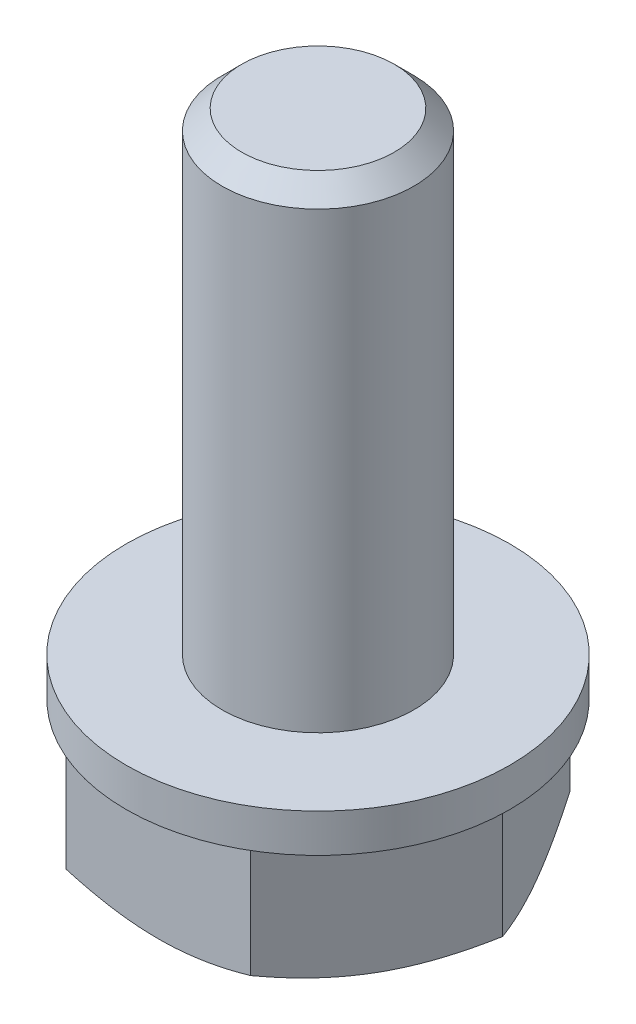
ISO-10303-21;
HEADER;
FILE_DESCRIPTION(('STEP AP214'),'2;1');
FILE_NAME('part.step','',(''),(''),'','','');
FILE_SCHEMA(('AUTOMOTIVE_DESIGN { 1 0 10303 214 1 1 1 1 }'));
ENDSEC;
DATA;
#1=APPLICATION_CONTEXT('core data for automotive mechanical design processes');
#2=APPLICATION_PROTOCOL_DEFINITION('international standard','automotive_design',2000,#1);
#3=PRODUCT_CONTEXT('',#1,'mechanical');
#4=PRODUCT('Part','Part','',(#3));
#5=PRODUCT_RELATED_PRODUCT_CATEGORY('part','',(#4));
#6=PRODUCT_DEFINITION_FORMATION('','',#4);
#7=PRODUCT_DEFINITION_CONTEXT('part definition',#1,'design');
#8=PRODUCT_DEFINITION('design','',#6,#7);
#9=PRODUCT_DEFINITION_SHAPE('','',#8);
#10=(LENGTH_UNIT() NAMED_UNIT(*) SI_UNIT(.MILLI.,.METRE.));
#11=(NAMED_UNIT(*) PLANE_ANGLE_UNIT() SI_UNIT($,.RADIAN.));
#12=(NAMED_UNIT(*) SI_UNIT($,.STERADIAN.) SOLID_ANGLE_UNIT());
#13=UNCERTAINTY_MEASURE_WITH_UNIT(LENGTH_MEASURE(1.E-05),#10,'distance_accuracy_value','');
#14=(GEOMETRIC_REPRESENTATION_CONTEXT(3) GLOBAL_UNCERTAINTY_ASSIGNED_CONTEXT((#13)) GLOBAL_UNIT_ASSIGNED_CONTEXT((#10,
#11,#12)) REPRESENTATION_CONTEXT('',''));
#15=CARTESIAN_POINT('',(0.,0.,0.));
#16=DIRECTION('',(0.,0.,1.));
#17=DIRECTION('',(1.,0.,0.));
#18=AXIS2_PLACEMENT_3D('',#15,#16,#17);
#19=CARTESIAN_POINT('',(-17.677669529664,-54.8,15.177669529664));
#20=DIRECTION('',(0.,-1.,0.));
#21=DIRECTION('',(0.,0.,-1.));
#22=AXIS2_PLACEMENT_3D('',#19,#20,#21);
#23=PLANE('',#22);
#24=CARTESIAN_POINT('',(-17.677669529664,-54.8,17.677669529664));
#25=DIRECTION('',(0.,-1.,0.));
#26=DIRECTION('',(0.,0.,-1.));
#27=AXIS2_PLACEMENT_3D('',#24,#25,#26);
#28=CIRCLE('',#27,5.);
#29=CARTESIAN_POINT('',(-17.677669529664,-54.8,12.677669529664));
#30=VERTEX_POINT('',#29);
#31=CARTESIAN_POINT('',(-13.3475425107418,-54.8,15.1776695296639));
#32=VERTEX_POINT('',#31);
#33=EDGE_CURVE('E93',#30,#32,#28,.T.);
#34=ORIENTED_EDGE('',*,*,#33,.T.);
#35=CARTESIAN_POINT('',(-17.677669529664,-54.8,17.677669529664));
#36=DIRECTION('',(0.,-1.,0.));
#37=DIRECTION('',(0.,0.,-1.));
#38=AXIS2_PLACEMENT_3D('',#35,#36,#37);
#39=CIRCLE('',#38,5.);
#40=CARTESIAN_POINT('',(-13.3475425107418,-54.8,20.1776695296641));
#41=VERTEX_POINT('',#40);
#42=EDGE_CURVE('E130',#32,#41,#39,.T.);
#43=ORIENTED_EDGE('',*,*,#42,.T.);
#44=CARTESIAN_POINT('',(-17.677669529664,-54.8,17.677669529664));
#45=DIRECTION('',(0.,-1.,0.));
#46=DIRECTION('',(0.,0.,-1.));
#47=AXIS2_PLACEMENT_3D('',#44,#45,#46);
#48=CIRCLE('',#47,5.);
#49=CARTESIAN_POINT('',(-17.677669529664,-54.8,22.677669529664));
#50=VERTEX_POINT('',#49);
#51=EDGE_CURVE('E133',#41,#50,#48,.T.);
#52=ORIENTED_EDGE('',*,*,#51,.T.);
#53=CARTESIAN_POINT('',(-17.677669529664,-54.8,17.677669529664));
#54=DIRECTION('',(0.,-1.,0.));
#55=DIRECTION('',(0.,0.,-1.));
#56=AXIS2_PLACEMENT_3D('',#53,#54,#55);
#57=CIRCLE('',#56,5.);
#58=CARTESIAN_POINT('',(-22.0077965485861,-54.8,20.1776695296641));
#59=VERTEX_POINT('',#58);
#60=EDGE_CURVE('E99',#50,#59,#57,.T.);
#61=ORIENTED_EDGE('',*,*,#60,.T.);
#62=CARTESIAN_POINT('',(-17.677669529664,-54.8,17.677669529664));
#63=DIRECTION('',(0.,-1.,0.));
#64=DIRECTION('',(0.,0.,-1.));
#65=AXIS2_PLACEMENT_3D('',#62,#63,#64);
#66=CIRCLE('',#65,5.);
#67=CARTESIAN_POINT('',(-22.0077965485861,-54.8,15.1776695296639));
#68=VERTEX_POINT('',#67);
#69=EDGE_CURVE('E94',#59,#68,#66,.T.);
#70=ORIENTED_EDGE('',*,*,#69,.T.);
#71=CARTESIAN_POINT('',(-17.677669529664,-54.8,17.677669529664));
#72=DIRECTION('',(0.,-1.,0.));
#73=DIRECTION('',(0.,0.,-1.));
#74=AXIS2_PLACEMENT_3D('',#71,#72,#73);
#75=CIRCLE('',#74,5.);
#76=EDGE_CURVE('E19',#68,#30,#75,.T.);
#77=ORIENTED_EDGE('',*,*,#76,.T.);
#78=EDGE_LOOP('',(#34,#43,#52,#61,#70,#77));
#79=FACE_BOUND('',#78,.T.);
#80=ADVANCED_FACE('F15',(#79),#23,.T.);
#81=CARTESIAN_POINT('',(-17.677669529664,-51.9113248654052,17.677669529664));
#82=DIRECTION('',(0.,1.,0.));
#83=DIRECTION('',(0.,0.,-1.));
#84=AXIS2_PLACEMENT_3D('',#81,#82,#83);
#85=CYLINDRICAL_SURFACE('',#84,6.);
#86=CARTESIAN_POINT('',(-17.677669529664,-49.6,17.677669529664));
#87=DIRECTION('',(0.,-1.,0.));
#88=DIRECTION('',(0.,0.,-1.));
#89=AXIS2_PLACEMENT_3D('',#86,#87,#88);
#90=CIRCLE('',#89,6.);
#91=CARTESIAN_POINT('',(-17.677669529664,-49.6,11.677669529664));
#92=VERTEX_POINT('',#91);
#93=EDGE_CURVE('E10',#92,#92,#90,.T.);
#94=ORIENTED_EDGE('',*,*,#93,.T.);
#95=EDGE_LOOP('',(#94));
#96=FACE_BOUND('',#95,.T.);
#97=CARTESIAN_POINT('',(-17.677669529664,-50.8,17.677669529664));
#98=DIRECTION('',(0.,1.,0.));
#99=DIRECTION('',(0.,0.,-1.));
#100=AXIS2_PLACEMENT_3D('',#97,#98,#99);
#101=CIRCLE('',#100,6.);
#102=CARTESIAN_POINT('',(-17.677669529664,-50.8,11.677669529664));
#103=VERTEX_POINT('',#102);
#104=EDGE_CURVE('E102',#103,#103,#101,.T.);
#105=ORIENTED_EDGE('',*,*,#104,.T.);
#106=EDGE_LOOP('',(#105));
#107=FACE_BOUND('',#106,.T.);
#108=ADVANCED_FACE('F294',(#96,#107),#85,.T.);
#109=CARTESIAN_POINT('',(-17.677669529664,-49.6,13.177669529664));
#110=DIRECTION('',(0.,1.,0.));
#111=DIRECTION('',(0.,0.,1.));
#112=AXIS2_PLACEMENT_3D('',#109,#110,#111);
#113=PLANE('',#112);
#114=CARTESIAN_POINT('',(-17.677669529664,-49.6,17.677669529664));
#115=DIRECTION('',(0.,-1.,0.));
#116=DIRECTION('',(0.,0.,-1.));
#117=AXIS2_PLACEMENT_3D('',#114,#115,#116);
#118=CIRCLE('',#117,3.);
#119=CARTESIAN_POINT('',(-17.677669529664,-49.6,14.677669529664));
#120=VERTEX_POINT('',#119);
#121=EDGE_CURVE('E25',#120,#120,#118,.T.);
#122=ORIENTED_EDGE('',*,*,#121,.T.);
#123=EDGE_LOOP('',(#122));
#124=FACE_BOUND('',#123,.T.);
#125=ORIENTED_EDGE('',*,*,#93,.F.);
#126=EDGE_LOOP('',(#125));
#127=FACE_BOUND('',#126,.T.);
#128=ADVANCED_FACE('F299',(#124,#127),#113,.T.);
#129=CARTESIAN_POINT('',(-17.677669529664,-42.50675,17.677669529664));
#130=DIRECTION('',(0.,1.,0.));
#131=DIRECTION('',(0.,0.,-1.));
#132=AXIS2_PLACEMENT_3D('',#129,#130,#131);
#133=CYLINDRICAL_SURFACE('',#132,3.);
#134=CARTESIAN_POINT('',(-17.677669529664,-35.4135,17.677669529664));
#135=DIRECTION('',(0.,-1.,0.));
#136=DIRECTION('',(0.,0.,-1.));
#137=AXIS2_PLACEMENT_3D('',#134,#135,#136);
#138=CIRCLE('',#137,3.);
#139=CARTESIAN_POINT('',(-17.677669529664,-35.4135,14.677669529664));
#140=VERTEX_POINT('',#139);
#141=EDGE_CURVE('E174',#140,#140,#138,.T.);
#142=ORIENTED_EDGE('',*,*,#141,.T.);
#143=EDGE_LOOP('',(#142));
#144=FACE_BOUND('',#143,.T.);
#145=ORIENTED_EDGE('',*,*,#121,.F.);
#146=EDGE_LOOP('',(#145));
#147=FACE_BOUND('',#146,.T.);
#148=ADVANCED_FACE('F323',(#144,#147),#133,.T.);
#149=CARTESIAN_POINT('',(-17.677669529664,-35.10675,17.677669529664));
#150=DIRECTION('',(0.,-1.,0.));
#151=DIRECTION('',(0.,0.,-1.));
#152=AXIS2_PLACEMENT_3D('',#149,#150,#151);
#153=CONICAL_SURFACE('',#152,2.69325,0.785398163397448);
#154=CARTESIAN_POINT('',(-17.677669529664,-34.8,17.677669529664));
#155=DIRECTION('',(0.,-1.,0.));
#156=DIRECTION('',(0.,0.,-1.));
#157=AXIS2_PLACEMENT_3D('',#154,#155,#156);
#158=CIRCLE('',#157,2.3865);
#159=CARTESIAN_POINT('',(-17.677669529664,-34.8,15.291169529664));
#160=VERTEX_POINT('',#159);
#161=EDGE_CURVE('E124',#160,#160,#158,.T.);
#162=ORIENTED_EDGE('',*,*,#161,.T.);
#163=EDGE_LOOP('',(#162));
#164=FACE_BOUND('',#163,.T.);
#165=ORIENTED_EDGE('',*,*,#141,.F.);
#166=EDGE_LOOP('',(#165));
#167=FACE_BOUND('',#166,.T.);
#168=ADVANCED_FACE('F307',(#164,#167),#153,.T.);
#169=CARTESIAN_POINT('',(-17.677669529664,-34.8,16.484419529664));
#170=DIRECTION('',(0.,1.,0.));
#171=DIRECTION('',(0.,0.,1.));
#172=AXIS2_PLACEMENT_3D('',#169,#170,#171);
#173=PLANE('',#172);
#174=ORIENTED_EDGE('',*,*,#161,.F.);
#175=EDGE_LOOP('',(#174));
#176=FACE_BOUND('',#175,.T.);
#177=ADVANCED_FACE('F304',(#176),#173,.T.);
#178=CARTESIAN_POINT('',(-17.677669529664,-54.5113248654052,17.677669529664));
#179=DIRECTION('',(0.,1.,0.));
#180=DIRECTION('',(0.,0.,-1.));
#181=AXIS2_PLACEMENT_3D('',#178,#179,#180);
#182=CONICAL_SURFACE('',#181,5.5,1.04719755119662);
#183=CARTESIAN_POINT('',(-17.677669529664,-54.8,22.677669529664));
#184=CARTESIAN_POINT('',(-19.0174154918196,-54.8,22.677669529664));
#185=CARTESIAN_POINT('',(-20.5644208756121,-54.3534180126148,22.677669529664));
#186=(BOUNDED_CURVE() B_SPLINE_CURVE(2,(#183,#184,#185),.UNSPECIFIED.,.F.,
.F.) B_SPLINE_CURVE_WITH_KNOTS((3,3),(3.37692975540509,6.36174641112158),
.UNSPECIFIED.) CURVE() GEOMETRIC_REPRESENTATION_ITEM() RATIONAL_B_SPLINE_CURVE((1.,
1.04314139574021,1.01001874935746)) REPRESENTATION_ITEM(''));
#187=CARTESIAN_POINT('',(-20.5644208756121,-54.3534180126148,22.677669529664));
#188=VERTEX_POINT('',#187);
#189=EDGE_CURVE('E208',#50,#188,#186,.T.);
#190=ORIENTED_EDGE('',*,*,#189,.T.);
#191=CARTESIAN_POINT('',(-20.5644208756121,-54.3534180126148,22.677669529664));
#192=CARTESIAN_POINT('',(-21.3379235675084,-54.8,21.3379235675084));
#193=CARTESIAN_POINT('',(-22.0077965485861,-54.8,20.1776695296641));
#194=(BOUNDED_CURVE() B_SPLINE_CURVE(2,(#191,#192,#193),.UNSPECIFIED.,.F.,
.F.) B_SPLINE_CURVE_WITH_KNOTS((3,3),(0.392113099688607,3.37692975540508),
.UNSPECIFIED.) CURVE() GEOMETRIC_REPRESENTATION_ITEM() RATIONAL_B_SPLINE_CURVE((1.01001874935746,
1.04314139574019,1.)) REPRESENTATION_ITEM(''));
#195=EDGE_CURVE('E141',#188,#59,#194,.T.);
#196=ORIENTED_EDGE('',*,*,#195,.T.);
#197=ORIENTED_EDGE('',*,*,#60,.F.);
#198=EDGE_LOOP('',(#190,#196,#197));
#199=FACE_BOUND('',#198,.T.);
#200=ADVANCED_FACE('F279',(#199),#182,.T.);
#201=CARTESIAN_POINT('',(-17.677669529664,-54.5113248654052,17.677669529664));
#202=DIRECTION('',(0.,1.,0.));
#203=DIRECTION('',(0.,0.,-1.));
#204=AXIS2_PLACEMENT_3D('',#201,#202,#203);
#205=CONICAL_SURFACE('',#204,5.5,1.04719755119662);
#206=CARTESIAN_POINT('',(-13.3475425107418,-54.8,20.1776695296641));
#207=CARTESIAN_POINT('',(-14.0174154918197,-54.8000000000001,21.3379235675084));
#208=CARTESIAN_POINT('',(-14.7909181837159,-54.3534180126148,22.677669529664));
#209=(BOUNDED_CURVE() B_SPLINE_CURVE(2,(#206,#207,#208),.UNSPECIFIED.,.F.,
.F.) B_SPLINE_CURVE_WITH_KNOTS((3,3),(3.37692975540508,6.36174641112157),
.UNSPECIFIED.) CURVE() GEOMETRIC_REPRESENTATION_ITEM() RATIONAL_B_SPLINE_CURVE((1.,
1.0431413957402,1.01001874935746)) REPRESENTATION_ITEM(''));
#210=CARTESIAN_POINT('',(-14.7909181837159,-54.3534180126148,22.677669529664));
#211=VERTEX_POINT('',#210);
#212=EDGE_CURVE('E134',#41,#211,#209,.T.);
#213=ORIENTED_EDGE('',*,*,#212,.T.);
#214=CARTESIAN_POINT('',(-14.7909181837159,-54.3534180126148,22.677669529664));
#215=CARTESIAN_POINT('',(-16.3379235675084,-54.8,22.677669529664));
#216=CARTESIAN_POINT('',(-17.677669529664,-54.8,22.677669529664));
#217=(BOUNDED_CURVE() B_SPLINE_CURVE(2,(#214,#215,#216),.UNSPECIFIED.,.F.,
.F.) B_SPLINE_CURVE_WITH_KNOTS((3,3),(0.392113099688602,3.37692975540509),
.UNSPECIFIED.) CURVE() GEOMETRIC_REPRESENTATION_ITEM() RATIONAL_B_SPLINE_CURVE((1.01001874935746,
1.04314139574021,1.)) REPRESENTATION_ITEM(''));
#218=EDGE_CURVE('E139',#211,#50,#217,.T.);
#219=ORIENTED_EDGE('',*,*,#218,.T.);
#220=ORIENTED_EDGE('',*,*,#51,.F.);
#221=EDGE_LOOP('',(#213,#219,#220));
#222=FACE_BOUND('',#221,.T.);
#223=ADVANCED_FACE('F277',(#222),#205,.T.);
#224=CARTESIAN_POINT('',(-17.677669529664,-54.5113248654052,17.677669529664));
#225=DIRECTION('',(0.,1.,0.));
#226=DIRECTION('',(0.,0.,-1.));
#227=AXIS2_PLACEMENT_3D('',#224,#225,#226);
#228=CONICAL_SURFACE('',#227,5.5,1.04719755119662);
#229=CARTESIAN_POINT('',(-13.3475425107418,-54.8,15.1776695296639));
#230=CARTESIAN_POINT('',(-12.677669529664,-54.8,16.3379235675084));
#231=CARTESIAN_POINT('',(-11.9041668377677,-54.3534180126148,17.677669529664));
#232=(BOUNDED_CURVE() B_SPLINE_CURVE(2,(#229,#230,#231),.UNSPECIFIED.,.F.,
.F.) B_SPLINE_CURVE_WITH_KNOTS((3,3),(3.37692975540508,6.36174641112167),
.UNSPECIFIED.) CURVE() GEOMETRIC_REPRESENTATION_ITEM() RATIONAL_B_SPLINE_CURVE((1.,
1.04314139574019,1.01001874935746)) REPRESENTATION_ITEM(''));
#233=CARTESIAN_POINT('',(-11.9041668377677,-54.3534180126148,17.677669529664));
#234=VERTEX_POINT('',#233);
#235=EDGE_CURVE('E154',#32,#234,#232,.T.);
#236=ORIENTED_EDGE('',*,*,#235,.T.);
#237=CARTESIAN_POINT('',(-11.9041668377677,-54.3534180126148,17.677669529664));
#238=CARTESIAN_POINT('',(-12.677669529664,-54.8,19.0174154918197));
#239=CARTESIAN_POINT('',(-13.3475425107418,-54.8,20.1776695296641));
#240=(BOUNDED_CURVE() B_SPLINE_CURVE(2,(#237,#238,#239),.UNSPECIFIED.,.F.,
.F.) B_SPLINE_CURVE_WITH_KNOTS((3,3),(0.392113099688502,3.37692975540508),
.UNSPECIFIED.) CURVE() GEOMETRIC_REPRESENTATION_ITEM() RATIONAL_B_SPLINE_CURVE((1.01001874935746,
1.04314139574019,1.)) REPRESENTATION_ITEM(''));
#241=EDGE_CURVE('E183',#234,#41,#240,.T.);
#242=ORIENTED_EDGE('',*,*,#241,.T.);
#243=ORIENTED_EDGE('',*,*,#42,.F.);
#244=EDGE_LOOP('',(#236,#242,#243));
#245=FACE_BOUND('',#244,.T.);
#246=ADVANCED_FACE('F313',(#245),#228,.T.);
#247=CARTESIAN_POINT('',(-17.677669529664,-54.5113248654052,17.677669529664));
#248=DIRECTION('',(0.,1.,0.));
#249=DIRECTION('',(0.,0.,-1.));
#250=AXIS2_PLACEMENT_3D('',#247,#248,#249);
#251=CONICAL_SURFACE('',#250,5.5,1.04719755119662);
#252=CARTESIAN_POINT('',(-14.7909181837159,-54.3534180126148,12.677669529664));
#253=CARTESIAN_POINT('',(-14.0174154918196,-54.8,14.0174154918196));
#254=CARTESIAN_POINT('',(-13.3475425107418,-54.8,15.1776695296639));
#255=(BOUNDED_CURVE() B_SPLINE_CURVE(2,(#252,#253,#254),.UNSPECIFIED.,.F.,
.F.) B_SPLINE_CURVE_WITH_KNOTS((3,3),(0.392113099688607,3.37692975540508),
.UNSPECIFIED.) CURVE() GEOMETRIC_REPRESENTATION_ITEM() RATIONAL_B_SPLINE_CURVE((1.01001874935746,
1.04314139574019,1.)) REPRESENTATION_ITEM(''));
#256=CARTESIAN_POINT('',(-14.7909181837159,-54.3534180126148,12.677669529664));
#257=VERTEX_POINT('',#256);
#258=EDGE_CURVE('E218',#257,#32,#255,.T.);
#259=ORIENTED_EDGE('',*,*,#258,.T.);
#260=ORIENTED_EDGE('',*,*,#33,.F.);
#261=CARTESIAN_POINT('',(-17.677669529664,-54.8,12.677669529664));
#262=CARTESIAN_POINT('',(-16.3379235675084,-54.8,12.677669529664));
#263=CARTESIAN_POINT('',(-14.7909181837159,-54.3534180126148,12.677669529664));
#264=(BOUNDED_CURVE() B_SPLINE_CURVE(2,(#261,#262,#263),.UNSPECIFIED.,.F.,
.F.) B_SPLINE_CURVE_WITH_KNOTS((3,3),(3.37692975540509,6.36174641112158),
.UNSPECIFIED.) CURVE() GEOMETRIC_REPRESENTATION_ITEM() RATIONAL_B_SPLINE_CURVE((1.,
1.04314139574021,1.01001874935746)) REPRESENTATION_ITEM(''));
#265=EDGE_CURVE('E220',#30,#257,#264,.T.);
#266=ORIENTED_EDGE('',*,*,#265,.T.);
#267=EDGE_LOOP('',(#259,#260,#266));
#268=FACE_BOUND('',#267,.T.);
#269=ADVANCED_FACE('F17',(#268),#251,.T.);
#270=CARTESIAN_POINT('',(-17.677669529664,-54.5113248654052,17.677669529664));
#271=DIRECTION('',(0.,1.,0.));
#272=DIRECTION('',(0.,0.,-1.));
#273=AXIS2_PLACEMENT_3D('',#270,#271,#272);
#274=CONICAL_SURFACE('',#273,5.5,1.04719755119662);
#275=CARTESIAN_POINT('',(-20.5644208756121,-54.3534180126148,12.677669529664));
#276=CARTESIAN_POINT('',(-19.0174154918196,-54.8,12.677669529664));
#277=CARTESIAN_POINT('',(-17.677669529664,-54.8,12.677669529664));
#278=(BOUNDED_CURVE() B_SPLINE_CURVE(2,(#275,#276,#277),.UNSPECIFIED.,.F.,
.F.) B_SPLINE_CURVE_WITH_KNOTS((3,3),(0.392113099688602,3.37692975540509),
.UNSPECIFIED.) CURVE() GEOMETRIC_REPRESENTATION_ITEM() RATIONAL_B_SPLINE_CURVE((1.01001874935746,
1.04314139574021,1.)) REPRESENTATION_ITEM(''));
#279=CARTESIAN_POINT('',(-20.5644208756121,-54.3534180126148,12.677669529664));
#280=VERTEX_POINT('',#279);
#281=EDGE_CURVE('E89',#280,#30,#278,.T.);
#282=ORIENTED_EDGE('',*,*,#281,.T.);
#283=ORIENTED_EDGE('',*,*,#76,.F.);
#284=CARTESIAN_POINT('',(-22.0077965485861,-54.8,15.1776695296639));
#285=CARTESIAN_POINT('',(-21.3379235675084,-54.8000000000001,14.0174154918196));
#286=CARTESIAN_POINT('',(-20.5644208756121,-54.3534180126148,12.677669529664));
#287=(BOUNDED_CURVE() B_SPLINE_CURVE(2,(#284,#285,#286),.UNSPECIFIED.,.F.,
.F.) B_SPLINE_CURVE_WITH_KNOTS((3,3),(3.37692975540508,6.36174641112157),
.UNSPECIFIED.) CURVE() GEOMETRIC_REPRESENTATION_ITEM() RATIONAL_B_SPLINE_CURVE((1.,
1.0431413957402,1.01001874935746)) REPRESENTATION_ITEM(''));
#288=EDGE_CURVE('E86',#68,#280,#287,.T.);
#289=ORIENTED_EDGE('',*,*,#288,.T.);
#290=EDGE_LOOP('',(#282,#283,#289));
#291=FACE_BOUND('',#290,.T.);
#292=ADVANCED_FACE('F84',(#291),#274,.T.);
#293=CARTESIAN_POINT('',(-17.677669529664,-54.5113248654052,17.677669529664));
#294=DIRECTION('',(0.,1.,0.));
#295=DIRECTION('',(0.,0.,-1.));
#296=AXIS2_PLACEMENT_3D('',#293,#294,#295);
#297=CONICAL_SURFACE('',#296,5.5,1.04719755119662);
#298=CARTESIAN_POINT('',(-23.4511722215603,-54.3534180126148,17.677669529664));
#299=CARTESIAN_POINT('',(-22.677669529664,-54.8,16.3379235675083));
#300=CARTESIAN_POINT('',(-22.0077965485861,-54.8,15.1776695296639));
#301=(BOUNDED_CURVE() B_SPLINE_CURVE(2,(#298,#299,#300),.UNSPECIFIED.,.F.,
.F.) B_SPLINE_CURVE_WITH_KNOTS((3,3),(0.392113099688502,3.37692975540508),
.UNSPECIFIED.) CURVE() GEOMETRIC_REPRESENTATION_ITEM() RATIONAL_B_SPLINE_CURVE((1.01001874935746,
1.04314139574019,1.)) REPRESENTATION_ITEM(''));
#302=CARTESIAN_POINT('',(-23.4511722215603,-54.3534180126148,17.677669529664));
#303=VERTEX_POINT('',#302);
#304=EDGE_CURVE('E105',#303,#68,#301,.T.);
#305=ORIENTED_EDGE('',*,*,#304,.T.);
#306=ORIENTED_EDGE('',*,*,#69,.F.);
#307=CARTESIAN_POINT('',(-22.0077965485861,-54.8,20.1776695296641));
#308=CARTESIAN_POINT('',(-22.677669529664,-54.8,19.0174154918197));
#309=CARTESIAN_POINT('',(-23.4511722215603,-54.3534180126148,17.677669529664));
#310=(BOUNDED_CURVE() B_SPLINE_CURVE(2,(#307,#308,#309),.UNSPECIFIED.,.F.,
.F.) B_SPLINE_CURVE_WITH_KNOTS((3,3),(3.37692975540508,6.36174641112167),
.UNSPECIFIED.) CURVE() GEOMETRIC_REPRESENTATION_ITEM() RATIONAL_B_SPLINE_CURVE((1.,
1.04314139574019,1.01001874935746)) REPRESENTATION_ITEM(''));
#311=EDGE_CURVE('E108',#59,#303,#310,.T.);
#312=ORIENTED_EDGE('',*,*,#311,.T.);
#313=EDGE_LOOP('',(#305,#306,#312));
#314=FACE_BOUND('',#313,.T.);
#315=ADVANCED_FACE('F106',(#314),#297,.T.);
#316=CARTESIAN_POINT('',(-17.677669529664,-50.8,17.677669529664));
#317=DIRECTION('',(0.,-1.,0.));
#318=DIRECTION('',(-1.,0.,0.));
#319=AXIS2_PLACEMENT_3D('',#316,#317,#318);
#320=PLANE('',#319);
#321=DIRECTION('',(0.500000000000009,0.,-0.866025403784433));
#322=VECTOR('',#321,1.);
#323=CARTESIAN_POINT('',(-11.9041668377677,-50.8,17.677669529664));
#324=LINE('',#323,#322);
#325=CARTESIAN_POINT('',(-14.7909181837159,-50.8,22.677669529664));
#326=VERTEX_POINT('',#325);
#327=CARTESIAN_POINT('',(-11.9041668377677,-50.8,17.677669529664));
#328=VERTEX_POINT('',#327);
#329=EDGE_CURVE('E181',#326,#328,#324,.T.);
#330=ORIENTED_EDGE('',*,*,#329,.T.);
#331=DIRECTION('',(-0.500000000000009,0.,-0.866025403784433));
#332=VECTOR('',#331,1.);
#333=CARTESIAN_POINT('',(-14.7909181837159,-50.8,12.677669529664));
#334=LINE('',#333,#332);
#335=CARTESIAN_POINT('',(-14.7909181837159,-50.8,12.677669529664));
#336=VERTEX_POINT('',#335);
#337=EDGE_CURVE('E155',#328,#336,#334,.T.);
#338=ORIENTED_EDGE('',*,*,#337,.T.);
#339=DIRECTION('',(-1.,0.,0.));
#340=VECTOR('',#339,1.);
#341=CARTESIAN_POINT('',(-20.5644208756121,-50.8,12.677669529664));
#342=LINE('',#341,#340);
#343=CARTESIAN_POINT('',(-20.5644208756121,-50.8,12.677669529664));
#344=VERTEX_POINT('',#343);
#345=EDGE_CURVE('E117',#336,#344,#342,.T.);
#346=ORIENTED_EDGE('',*,*,#345,.T.);
#347=DIRECTION('',(-0.500000000000009,0.,0.866025403784433));
#348=VECTOR('',#347,1.);
#349=CARTESIAN_POINT('',(-23.4511722215603,-50.8,17.677669529664));
#350=LINE('',#349,#348);
#351=CARTESIAN_POINT('',(-23.4511722215603,-50.8,17.677669529664));
#352=VERTEX_POINT('',#351);
#353=EDGE_CURVE('E159',#344,#352,#350,.T.);
#354=ORIENTED_EDGE('',*,*,#353,.T.);
#355=DIRECTION('',(0.500000000000009,0.,0.866025403784433));
#356=VECTOR('',#355,1.);
#357=CARTESIAN_POINT('',(-20.5644208756121,-50.8,22.677669529664));
#358=LINE('',#357,#356);
#359=CARTESIAN_POINT('',(-20.5644208756121,-50.8,22.677669529664));
#360=VERTEX_POINT('',#359);
#361=EDGE_CURVE('E148',#352,#360,#358,.T.);
#362=ORIENTED_EDGE('',*,*,#361,.T.);
#363=DIRECTION('',(1.,0.,0.));
#364=VECTOR('',#363,1.);
#365=CARTESIAN_POINT('',(-14.7909181837159,-50.8,22.677669529664));
#366=LINE('',#365,#364);
#367=EDGE_CURVE('E173',#360,#326,#366,.T.);
#368=ORIENTED_EDGE('',*,*,#367,.T.);
#369=EDGE_LOOP('',(#330,#338,#346,#354,#362,#368));
#370=FACE_BOUND('',#369,.T.);
#371=ORIENTED_EDGE('',*,*,#104,.F.);
#372=EDGE_LOOP('',(#371));
#373=FACE_BOUND('',#372,.T.);
#374=ADVANCED_FACE('F267',(#370,#373),#320,.T.);
#375=CARTESIAN_POINT('',(-23.4511722215603,-54.8,17.677669529664));
#376=DIRECTION('',(0.866025403784433,0.,-0.500000000000009));
#377=DIRECTION('',(-0.500000000000009,0.,-0.866025403784433));
#378=AXIS2_PLACEMENT_3D('',#375,#376,#377);
#379=PLANE('',#378);
#380=ORIENTED_EDGE('',*,*,#311,.F.);
#381=ORIENTED_EDGE('',*,*,#195,.F.);
#382=DIRECTION('',(0.,1.,0.));
#383=VECTOR('',#382,1.);
#384=CARTESIAN_POINT('',(-20.5644208756121,-54.8,22.677669529664));
#385=LINE('',#384,#383);
#386=EDGE_CURVE('E206',#188,#360,#385,.T.);
#387=ORIENTED_EDGE('',*,*,#386,.T.);
#388=ORIENTED_EDGE('',*,*,#361,.F.);
#389=DIRECTION('',(0.,1.,0.));
#390=VECTOR('',#389,1.);
#391=CARTESIAN_POINT('',(-23.4511722215603,-54.8,17.677669529664));
#392=LINE('',#391,#390);
#393=EDGE_CURVE('E112',#303,#352,#392,.T.);
#394=ORIENTED_EDGE('',*,*,#393,.F.);
#395=EDGE_LOOP('',(#380,#381,#387,#388,#394));
#396=FACE_BOUND('',#395,.T.);
#397=ADVANCED_FACE('F281',(#396),#379,.F.);
#398=CARTESIAN_POINT('',(-20.5644208756121,-54.8,12.677669529664));
#399=DIRECTION('',(0.866025403784433,0.,0.500000000000009));
#400=DIRECTION('',(0.500000000000009,0.,-0.866025403784433));
#401=AXIS2_PLACEMENT_3D('',#398,#399,#400);
#402=PLANE('',#401);
#403=ORIENTED_EDGE('',*,*,#288,.F.);
#404=ORIENTED_EDGE('',*,*,#304,.F.);
#405=ORIENTED_EDGE('',*,*,#393,.T.);
#406=ORIENTED_EDGE('',*,*,#353,.F.);
#407=DIRECTION('',(0.,1.,0.));
#408=VECTOR('',#407,1.);
#409=CARTESIAN_POINT('',(-20.5644208756121,-54.8,12.677669529664));
#410=LINE('',#409,#408);
#411=EDGE_CURVE('E116',#280,#344,#410,.T.);
#412=ORIENTED_EDGE('',*,*,#411,.F.);
#413=EDGE_LOOP('',(#403,#404,#405,#406,#412));
#414=FACE_BOUND('',#413,.T.);
#415=ADVANCED_FACE('F114',(#414),#402,.F.);
#416=CARTESIAN_POINT('',(-14.7909181837159,-54.8,12.677669529664));
#417=DIRECTION('',(0.,0.,1.));
#418=DIRECTION('',(1.,0.,0.));
#419=AXIS2_PLACEMENT_3D('',#416,#417,#418);
#420=PLANE('',#419);
#421=ORIENTED_EDGE('',*,*,#265,.F.);
#422=ORIENTED_EDGE('',*,*,#281,.F.);
#423=ORIENTED_EDGE('',*,*,#411,.T.);
#424=ORIENTED_EDGE('',*,*,#345,.F.);
#425=DIRECTION('',(0.,1.,0.));
#426=VECTOR('',#425,1.);
#427=CARTESIAN_POINT('',(-14.7909181837159,-54.8,12.677669529664));
#428=LINE('',#427,#426);
#429=EDGE_CURVE('E168',#257,#336,#428,.T.);
#430=ORIENTED_EDGE('',*,*,#429,.F.);
#431=EDGE_LOOP('',(#421,#422,#423,#424,#430));
#432=FACE_BOUND('',#431,.T.);
#433=ADVANCED_FACE('F261',(#432),#420,.F.);
#434=CARTESIAN_POINT('',(-20.5644208756121,-54.8,22.677669529664));
#435=DIRECTION('',(0.,0.,-1.));
#436=DIRECTION('',(-1.,0.,0.));
#437=AXIS2_PLACEMENT_3D('',#434,#435,#436);
#438=PLANE('',#437);
#439=ORIENTED_EDGE('',*,*,#218,.F.);
#440=DIRECTION('',(0.,1.,0.));
#441=VECTOR('',#440,1.);
#442=CARTESIAN_POINT('',(-14.7909181837159,-54.8,22.677669529664));
#443=LINE('',#442,#441);
#444=EDGE_CURVE('E140',#211,#326,#443,.T.);
#445=ORIENTED_EDGE('',*,*,#444,.T.);
#446=ORIENTED_EDGE('',*,*,#367,.F.);
#447=ORIENTED_EDGE('',*,*,#386,.F.);
#448=ORIENTED_EDGE('',*,*,#189,.F.);
#449=EDGE_LOOP('',(#439,#445,#446,#447,#448));
#450=FACE_BOUND('',#449,.T.);
#451=ADVANCED_FACE('F272',(#450),#438,.F.);
#452=CARTESIAN_POINT('',(-14.7909181837159,-54.8,22.677669529664));
#453=DIRECTION('',(-0.866025403784433,0.,-0.500000000000009));
#454=DIRECTION('',(-0.500000000000009,0.,0.866025403784433));
#455=AXIS2_PLACEMENT_3D('',#452,#453,#454);
#456=PLANE('',#455);
#457=ORIENTED_EDGE('',*,*,#241,.F.);
#458=DIRECTION('',(0.,1.,0.));
#459=VECTOR('',#458,1.);
#460=CARTESIAN_POINT('',(-11.9041668377677,-54.8,17.677669529664));
#461=LINE('',#460,#459);
#462=EDGE_CURVE('E149',#234,#328,#461,.T.);
#463=ORIENTED_EDGE('',*,*,#462,.T.);
#464=ORIENTED_EDGE('',*,*,#329,.F.);
#465=ORIENTED_EDGE('',*,*,#444,.F.);
#466=ORIENTED_EDGE('',*,*,#212,.F.);
#467=EDGE_LOOP('',(#457,#463,#464,#465,#466));
#468=FACE_BOUND('',#467,.T.);
#469=ADVANCED_FACE('F275',(#468),#456,.F.);
#470=CARTESIAN_POINT('',(-11.9041668377677,-54.8,17.677669529664));
#471=DIRECTION('',(-0.866025403784433,0.,0.500000000000009));
#472=DIRECTION('',(0.500000000000009,0.,0.866025403784433));
#473=AXIS2_PLACEMENT_3D('',#470,#471,#472);
#474=PLANE('',#473);
#475=ORIENTED_EDGE('',*,*,#258,.F.);
#476=ORIENTED_EDGE('',*,*,#429,.T.);
#477=ORIENTED_EDGE('',*,*,#337,.F.);
#478=ORIENTED_EDGE('',*,*,#462,.F.);
#479=ORIENTED_EDGE('',*,*,#235,.F.);
#480=EDGE_LOOP('',(#475,#476,#477,#478,#479));
#481=FACE_BOUND('',#480,.T.);
#482=ADVANCED_FACE('F256',(#481),#474,.F.);
#483=CLOSED_SHELL('',(#80,#108,#128,#148,#168,#177,#200,#223,#246,#269,#292,#315,#374,#397,#415,
#433,#451,#469,#482));
#484=MANIFOLD_SOLID_BREP('B1',#483);
#485=ADVANCED_BREP_SHAPE_REPRESENTATION('',(#18,#484),#14);
#486=SHAPE_DEFINITION_REPRESENTATION(#9,#485);
ENDSEC;
END-ISO-10303-21;
